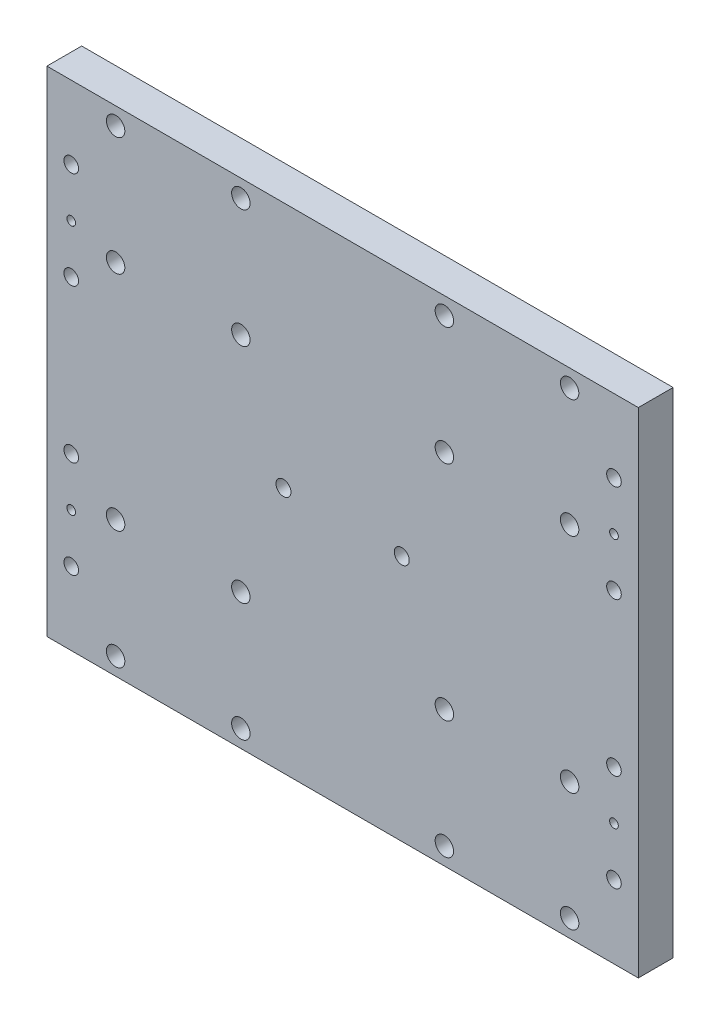
ISO-10303-21;
HEADER;
FILE_DESCRIPTION(('STEP AP214'),'2;1');
FILE_NAME('part.step','',(''),(''),'','','');
FILE_SCHEMA(('AUTOMOTIVE_DESIGN { 1 0 10303 214 1 1 1 1 }'));
ENDSEC;
DATA;
#1=APPLICATION_CONTEXT('core data for automotive mechanical design processes');
#2=APPLICATION_PROTOCOL_DEFINITION('international standard','automotive_design',2000,#1);
#3=PRODUCT_CONTEXT('',#1,'mechanical');
#4=PRODUCT('Part','Part','',(#3));
#5=PRODUCT_RELATED_PRODUCT_CATEGORY('part','',(#4));
#6=PRODUCT_DEFINITION_FORMATION('','',#4);
#7=PRODUCT_DEFINITION_CONTEXT('part definition',#1,'design');
#8=PRODUCT_DEFINITION('design','',#6,#7);
#9=PRODUCT_DEFINITION_SHAPE('','',#8);
#10=(LENGTH_UNIT() NAMED_UNIT(*) SI_UNIT(.MILLI.,.METRE.));
#11=(NAMED_UNIT(*) PLANE_ANGLE_UNIT() SI_UNIT($,.RADIAN.));
#12=(NAMED_UNIT(*) SI_UNIT($,.STERADIAN.) SOLID_ANGLE_UNIT());
#13=UNCERTAINTY_MEASURE_WITH_UNIT(LENGTH_MEASURE(1.E-05),#10,'distance_accuracy_value','');
#14=(GEOMETRIC_REPRESENTATION_CONTEXT(3) GLOBAL_UNCERTAINTY_ASSIGNED_CONTEXT((#13)) GLOBAL_UNIT_ASSIGNED_CONTEXT((#10,
#11,#12)) REPRESENTATION_CONTEXT('',''));
#15=CARTESIAN_POINT('',(0.,0.,0.));
#16=DIRECTION('',(0.,0.,1.));
#17=DIRECTION('',(1.,0.,0.));
#18=AXIS2_PLACEMENT_3D('',#15,#16,#17);
#19=CARTESIAN_POINT('',(0.,0.,5.));
#20=DIRECTION('',(0.,0.,1.));
#21=DIRECTION('',(1.,0.,0.));
#22=AXIS2_PLACEMENT_3D('',#19,#20,#21);
#23=PLANE('',#22);
#24=CARTESIAN_POINT('',(78.0000000000001,36.,5.));
#25=DIRECTION('',(0.,0.,-1.));
#26=DIRECTION('',(-1.,0.,0.));
#27=AXIS2_PLACEMENT_3D('',#24,#25,#26);
#28=CIRCLE('',#27,1.25);
#29=CARTESIAN_POINT('',(76.7500000000001,36.,5.));
#30=VERTEX_POINT('',#29);
#31=EDGE_CURVE('E131',#30,#30,#28,.T.);
#32=ORIENTED_EDGE('',*,*,#31,.T.);
#33=EDGE_LOOP('',(#32));
#34=FACE_BOUND('',#33,.T.);
#35=CARTESIAN_POINT('',(78.0000000000001,50.,5.));
#36=DIRECTION('',(0.,0.,1.));
#37=DIRECTION('',(1.,0.,0.));
#38=AXIS2_PLACEMENT_3D('',#35,#36,#37);
#39=CIRCLE('',#38,2.09999999999999);
#40=CARTESIAN_POINT('',(80.1000000000001,50.,5.));
#41=VERTEX_POINT('',#40);
#42=EDGE_CURVE('E127',#41,#41,#39,.T.);
#43=ORIENTED_EDGE('',*,*,#42,.F.);
#44=EDGE_LOOP('',(#43));
#45=FACE_BOUND('',#44,.T.);
#46=CARTESIAN_POINT('',(78.0000000000001,22.,5.));
#47=DIRECTION('',(0.,0.,1.));
#48=DIRECTION('',(1.,0.,0.));
#49=AXIS2_PLACEMENT_3D('',#46,#47,#48);
#50=CIRCLE('',#49,2.09999999999999);
#51=CARTESIAN_POINT('',(80.1000000000001,22.,5.));
#52=VERTEX_POINT('',#51);
#53=EDGE_CURVE('E123',#52,#52,#50,.T.);
#54=ORIENTED_EDGE('',*,*,#53,.F.);
#55=EDGE_LOOP('',(#54));
#56=FACE_BOUND('',#55,.T.);
#57=CARTESIAN_POINT('',(-78.0000000000001,36.,5.));
#58=DIRECTION('',(0.,0.,1.));
#59=DIRECTION('',(1.,0.,0.));
#60=AXIS2_PLACEMENT_3D('',#57,#58,#59);
#61=CIRCLE('',#60,1.25);
#62=CARTESIAN_POINT('',(-76.7500000000001,36.,5.));
#63=VERTEX_POINT('',#62);
#64=EDGE_CURVE('E122',#63,#63,#61,.T.);
#65=ORIENTED_EDGE('',*,*,#64,.F.);
#66=EDGE_LOOP('',(#65));
#67=FACE_BOUND('',#66,.T.);
#68=CARTESIAN_POINT('',(-78.0000000000001,50.,5.));
#69=DIRECTION('',(0.,0.,1.));
#70=DIRECTION('',(1.,0.,0.));
#71=AXIS2_PLACEMENT_3D('',#68,#69,#70);
#72=CIRCLE('',#71,2.09999999999999);
#73=CARTESIAN_POINT('',(-75.9000000000001,50.,5.));
#74=VERTEX_POINT('',#73);
#75=EDGE_CURVE('E118',#74,#74,#72,.T.);
#76=ORIENTED_EDGE('',*,*,#75,.F.);
#77=EDGE_LOOP('',(#76));
#78=FACE_BOUND('',#77,.T.);
#79=CARTESIAN_POINT('',(-78.0000000000001,22.,5.));
#80=DIRECTION('',(0.,0.,1.));
#81=DIRECTION('',(1.,0.,0.));
#82=AXIS2_PLACEMENT_3D('',#79,#80,#81);
#83=CIRCLE('',#82,2.09999999999999);
#84=CARTESIAN_POINT('',(-75.9000000000001,22.,5.));
#85=VERTEX_POINT('',#84);
#86=EDGE_CURVE('E114',#85,#85,#83,.T.);
#87=ORIENTED_EDGE('',*,*,#86,.F.);
#88=EDGE_LOOP('',(#87));
#89=FACE_BOUND('',#88,.T.);
#90=CARTESIAN_POINT('',(-17.,0.,5.));
#91=DIRECTION('',(0.,0.,1.));
#92=DIRECTION('',(1.,0.,0.));
#93=AXIS2_PLACEMENT_3D('',#90,#91,#92);
#94=CIRCLE('',#93,2.14999999999999);
#95=CARTESIAN_POINT('',(-14.85,0.,5.));
#96=VERTEX_POINT('',#95);
#97=EDGE_CURVE('E113',#96,#96,#94,.T.);
#98=ORIENTED_EDGE('',*,*,#97,.F.);
#99=EDGE_LOOP('',(#98));
#100=FACE_BOUND('',#99,.T.);
#101=CARTESIAN_POINT('',(17.,0.,5.));
#102=DIRECTION('',(0.,0.,1.));
#103=DIRECTION('',(1.,0.,0.));
#104=AXIS2_PLACEMENT_3D('',#101,#102,#103);
#105=CIRCLE('',#104,2.14999999999999);
#106=CARTESIAN_POINT('',(19.15,0.,5.));
#107=VERTEX_POINT('',#106);
#108=EDGE_CURVE('E183',#107,#107,#105,.T.);
#109=ORIENTED_EDGE('',*,*,#108,.F.);
#110=EDGE_LOOP('',(#109));
#111=FACE_BOUND('',#110,.T.);
#112=CARTESIAN_POINT('',(65.2500000000001,66.0000000000001,5.));
#113=DIRECTION('',(0.,0.,1.));
#114=DIRECTION('',(1.,0.,0.));
#115=AXIS2_PLACEMENT_3D('',#112,#113,#114);
#116=CIRCLE('',#115,2.65);
#117=CARTESIAN_POINT('',(67.9000000000001,66.0000000000001,5.));
#118=VERTEX_POINT('',#117);
#119=EDGE_CURVE('E189',#118,#118,#116,.T.);
#120=ORIENTED_EDGE('',*,*,#119,.F.);
#121=EDGE_LOOP('',(#120));
#122=FACE_BOUND('',#121,.T.);
#123=CARTESIAN_POINT('',(29.2500000000001,66.0000000000001,5.));
#124=DIRECTION('',(0.,0.,1.));
#125=DIRECTION('',(1.,0.,0.));
#126=AXIS2_PLACEMENT_3D('',#123,#124,#125);
#127=CIRCLE('',#126,2.65);
#128=CARTESIAN_POINT('',(31.9000000000001,66.0000000000001,5.));
#129=VERTEX_POINT('',#128);
#130=EDGE_CURVE('E195',#129,#129,#127,.T.);
#131=ORIENTED_EDGE('',*,*,#130,.F.);
#132=EDGE_LOOP('',(#131));
#133=FACE_BOUND('',#132,.T.);
#134=CARTESIAN_POINT('',(29.2500000000001,32.0000000000001,5.));
#135=DIRECTION('',(0.,0.,1.));
#136=DIRECTION('',(1.,0.,0.));
#137=AXIS2_PLACEMENT_3D('',#134,#135,#136);
#138=CIRCLE('',#137,2.65);
#139=CARTESIAN_POINT('',(31.9000000000001,32.0000000000001,5.));
#140=VERTEX_POINT('',#139);
#141=EDGE_CURVE('E201',#140,#140,#138,.T.);
#142=ORIENTED_EDGE('',*,*,#141,.F.);
#143=EDGE_LOOP('',(#142));
#144=FACE_BOUND('',#143,.T.);
#145=CARTESIAN_POINT('',(65.2500000000001,32.,5.));
#146=DIRECTION('',(0.,0.,1.));
#147=DIRECTION('',(1.,0.,0.));
#148=AXIS2_PLACEMENT_3D('',#145,#146,#147);
#149=CIRCLE('',#148,2.65);
#150=CARTESIAN_POINT('',(67.9000000000001,32.,5.));
#151=VERTEX_POINT('',#150);
#152=EDGE_CURVE('E207',#151,#151,#149,.T.);
#153=ORIENTED_EDGE('',*,*,#152,.F.);
#154=EDGE_LOOP('',(#153));
#155=FACE_BOUND('',#154,.T.);
#156=CARTESIAN_POINT('',(65.2500000000001,-66.0000000000001,5.));
#157=DIRECTION('',(0.,0.,1.));
#158=DIRECTION('',(1.,0.,0.));
#159=AXIS2_PLACEMENT_3D('',#156,#157,#158);
#160=CIRCLE('',#159,2.65);
#161=CARTESIAN_POINT('',(67.9000000000001,-66.0000000000001,5.));
#162=VERTEX_POINT('',#161);
#163=EDGE_CURVE('E213',#162,#162,#160,.T.);
#164=ORIENTED_EDGE('',*,*,#163,.F.);
#165=EDGE_LOOP('',(#164));
#166=FACE_BOUND('',#165,.T.);
#167=CARTESIAN_POINT('',(29.2500000000001,-66.0000000000001,5.));
#168=DIRECTION('',(0.,0.,1.));
#169=DIRECTION('',(1.,0.,0.));
#170=AXIS2_PLACEMENT_3D('',#167,#168,#169);
#171=CIRCLE('',#170,2.65);
#172=CARTESIAN_POINT('',(31.9000000000001,-66.0000000000001,5.));
#173=VERTEX_POINT('',#172);
#174=EDGE_CURVE('E219',#173,#173,#171,.T.);
#175=ORIENTED_EDGE('',*,*,#174,.F.);
#176=EDGE_LOOP('',(#175));
#177=FACE_BOUND('',#176,.T.);
#178=CARTESIAN_POINT('',(29.2500000000001,-32.0000000000001,5.));
#179=DIRECTION('',(0.,0.,1.));
#180=DIRECTION('',(1.,0.,0.));
#181=AXIS2_PLACEMENT_3D('',#178,#179,#180);
#182=CIRCLE('',#181,2.65);
#183=CARTESIAN_POINT('',(31.9000000000001,-32.0000000000001,5.));
#184=VERTEX_POINT('',#183);
#185=EDGE_CURVE('E225',#184,#184,#182,.T.);
#186=ORIENTED_EDGE('',*,*,#185,.F.);
#187=EDGE_LOOP('',(#186));
#188=FACE_BOUND('',#187,.T.);
#189=CARTESIAN_POINT('',(65.2500000000001,-32.,5.));
#190=DIRECTION('',(0.,0.,1.));
#191=DIRECTION('',(1.,0.,0.));
#192=AXIS2_PLACEMENT_3D('',#189,#190,#191);
#193=CIRCLE('',#192,2.65);
#194=CARTESIAN_POINT('',(67.9000000000001,-32.,5.));
#195=VERTEX_POINT('',#194);
#196=EDGE_CURVE('E231',#195,#195,#193,.T.);
#197=ORIENTED_EDGE('',*,*,#196,.F.);
#198=EDGE_LOOP('',(#197));
#199=FACE_BOUND('',#198,.T.);
#200=CARTESIAN_POINT('',(-65.2500000000001,-66.0000000000001,5.));
#201=DIRECTION('',(0.,0.,1.));
#202=DIRECTION('',(1.,0.,0.));
#203=AXIS2_PLACEMENT_3D('',#200,#201,#202);
#204=CIRCLE('',#203,2.65);
#205=CARTESIAN_POINT('',(-62.6000000000001,-66.0000000000001,5.));
#206=VERTEX_POINT('',#205);
#207=EDGE_CURVE('E237',#206,#206,#204,.T.);
#208=ORIENTED_EDGE('',*,*,#207,.F.);
#209=EDGE_LOOP('',(#208));
#210=FACE_BOUND('',#209,.T.);
#211=CARTESIAN_POINT('',(-29.2500000000001,-66.0000000000001,5.));
#212=DIRECTION('',(0.,0.,1.));
#213=DIRECTION('',(1.,0.,0.));
#214=AXIS2_PLACEMENT_3D('',#211,#212,#213);
#215=CIRCLE('',#214,2.65);
#216=CARTESIAN_POINT('',(-26.6000000000001,-66.0000000000001,5.));
#217=VERTEX_POINT('',#216);
#218=EDGE_CURVE('E243',#217,#217,#215,.T.);
#219=ORIENTED_EDGE('',*,*,#218,.F.);
#220=EDGE_LOOP('',(#219));
#221=FACE_BOUND('',#220,.T.);
#222=CARTESIAN_POINT('',(-29.2500000000001,-32.0000000000001,5.));
#223=DIRECTION('',(0.,0.,1.));
#224=DIRECTION('',(1.,0.,0.));
#225=AXIS2_PLACEMENT_3D('',#222,#223,#224);
#226=CIRCLE('',#225,2.65);
#227=CARTESIAN_POINT('',(-26.6000000000001,-32.0000000000001,5.));
#228=VERTEX_POINT('',#227);
#229=EDGE_CURVE('E249',#228,#228,#226,.T.);
#230=ORIENTED_EDGE('',*,*,#229,.F.);
#231=EDGE_LOOP('',(#230));
#232=FACE_BOUND('',#231,.T.);
#233=CARTESIAN_POINT('',(-65.2500000000001,-32.,5.));
#234=DIRECTION('',(0.,0.,1.));
#235=DIRECTION('',(1.,0.,0.));
#236=AXIS2_PLACEMENT_3D('',#233,#234,#235);
#237=CIRCLE('',#236,2.65);
#238=CARTESIAN_POINT('',(-62.6000000000001,-32.,5.));
#239=VERTEX_POINT('',#238);
#240=EDGE_CURVE('E255',#239,#239,#237,.T.);
#241=ORIENTED_EDGE('',*,*,#240,.F.);
#242=EDGE_LOOP('',(#241));
#243=FACE_BOUND('',#242,.T.);
#244=CARTESIAN_POINT('',(-65.2500000000001,66.0000000000001,5.));
#245=DIRECTION('',(0.,0.,1.));
#246=DIRECTION('',(1.,0.,0.));
#247=AXIS2_PLACEMENT_3D('',#244,#245,#246);
#248=CIRCLE('',#247,2.65);
#249=CARTESIAN_POINT('',(-62.6000000000001,66.0000000000001,5.));
#250=VERTEX_POINT('',#249);
#251=EDGE_CURVE('E261',#250,#250,#248,.T.);
#252=ORIENTED_EDGE('',*,*,#251,.F.);
#253=EDGE_LOOP('',(#252));
#254=FACE_BOUND('',#253,.T.);
#255=CARTESIAN_POINT('',(-29.2500000000001,66.0000000000001,5.));
#256=DIRECTION('',(0.,0.,1.));
#257=DIRECTION('',(1.,0.,0.));
#258=AXIS2_PLACEMENT_3D('',#255,#256,#257);
#259=CIRCLE('',#258,2.65);
#260=CARTESIAN_POINT('',(-26.6000000000001,66.0000000000001,5.));
#261=VERTEX_POINT('',#260);
#262=EDGE_CURVE('E267',#261,#261,#259,.T.);
#263=ORIENTED_EDGE('',*,*,#262,.F.);
#264=EDGE_LOOP('',(#263));
#265=FACE_BOUND('',#264,.T.);
#266=CARTESIAN_POINT('',(-29.2500000000001,32.0000000000001,5.));
#267=DIRECTION('',(0.,0.,1.));
#268=DIRECTION('',(1.,0.,0.));
#269=AXIS2_PLACEMENT_3D('',#266,#267,#268);
#270=CIRCLE('',#269,2.65);
#271=CARTESIAN_POINT('',(-26.6000000000001,32.0000000000001,5.));
#272=VERTEX_POINT('',#271);
#273=EDGE_CURVE('E273',#272,#272,#270,.T.);
#274=ORIENTED_EDGE('',*,*,#273,.F.);
#275=EDGE_LOOP('',(#274));
#276=FACE_BOUND('',#275,.T.);
#277=CARTESIAN_POINT('',(-65.2500000000001,32.,5.));
#278=DIRECTION('',(0.,0.,1.));
#279=DIRECTION('',(1.,0.,0.));
#280=AXIS2_PLACEMENT_3D('',#277,#278,#279);
#281=CIRCLE('',#280,2.65);
#282=CARTESIAN_POINT('',(-62.6000000000001,32.,5.));
#283=VERTEX_POINT('',#282);
#284=EDGE_CURVE('E279',#283,#283,#281,.T.);
#285=ORIENTED_EDGE('',*,*,#284,.F.);
#286=EDGE_LOOP('',(#285));
#287=FACE_BOUND('',#286,.T.);
#288=DIRECTION('',(0.,-1.,0.));
#289=VECTOR('',#288,1.);
#290=CARTESIAN_POINT('',(-85.0000000000001,-71.,5.));
#291=LINE('',#290,#289);
#292=CARTESIAN_POINT('',(-85.0000000000001,71.,5.));
#293=VERTEX_POINT('',#292);
#294=CARTESIAN_POINT('',(-85.0000000000001,-71.,5.));
#295=VERTEX_POINT('',#294);
#296=EDGE_CURVE('E88',#293,#295,#291,.T.);
#297=ORIENTED_EDGE('',*,*,#296,.T.);
#298=DIRECTION('',(1.,0.,0.));
#299=VECTOR('',#298,1.);
#300=CARTESIAN_POINT('',(85.,-71.,5.));
#301=LINE('',#300,#299);
#302=CARTESIAN_POINT('',(85.,-71.,5.));
#303=VERTEX_POINT('',#302);
#304=EDGE_CURVE('E83',#295,#303,#301,.T.);
#305=ORIENTED_EDGE('',*,*,#304,.T.);
#306=DIRECTION('',(0.,1.,0.));
#307=VECTOR('',#306,1.);
#308=CARTESIAN_POINT('',(85.,-71.,5.));
#309=LINE('',#308,#307);
#310=CARTESIAN_POINT('',(85.,71.,5.));
#311=VERTEX_POINT('',#310);
#312=EDGE_CURVE('E86',#303,#311,#309,.T.);
#313=ORIENTED_EDGE('',*,*,#312,.T.);
#314=DIRECTION('',(-1.,0.,0.));
#315=VECTOR('',#314,1.);
#316=CARTESIAN_POINT('',(85.,71.,5.));
#317=LINE('',#316,#315);
#318=EDGE_CURVE('E53',#311,#293,#317,.T.);
#319=ORIENTED_EDGE('',*,*,#318,.T.);
#320=EDGE_LOOP('',(#297,#305,#313,#319));
#321=FACE_BOUND('',#320,.T.);
#322=CARTESIAN_POINT('',(78.0000000000001,-22.,5.));
#323=DIRECTION('',(0.,0.,1.));
#324=DIRECTION('',(1.,0.,0.));
#325=AXIS2_PLACEMENT_3D('',#322,#323,#324);
#326=CIRCLE('',#325,2.09999999999999);
#327=CARTESIAN_POINT('',(80.1000000000001,-22.,5.));
#328=VERTEX_POINT('',#327);
#329=EDGE_CURVE('E132',#328,#328,#326,.T.);
#330=ORIENTED_EDGE('',*,*,#329,.F.);
#331=EDGE_LOOP('',(#330));
#332=FACE_BOUND('',#331,.T.);
#333=CARTESIAN_POINT('',(78.0000000000001,-50.,5.));
#334=DIRECTION('',(0.,0.,1.));
#335=DIRECTION('',(1.,0.,0.));
#336=AXIS2_PLACEMENT_3D('',#333,#334,#335);
#337=CIRCLE('',#336,2.09999999999999);
#338=CARTESIAN_POINT('',(80.1000000000001,-50.,5.));
#339=VERTEX_POINT('',#338);
#340=EDGE_CURVE('E135',#339,#339,#337,.T.);
#341=ORIENTED_EDGE('',*,*,#340,.F.);
#342=EDGE_LOOP('',(#341));
#343=FACE_BOUND('',#342,.T.);
#344=CARTESIAN_POINT('',(78.0000000000001,-36.,5.));
#345=DIRECTION('',(0.,0.,1.));
#346=DIRECTION('',(-1.,0.,0.));
#347=AXIS2_PLACEMENT_3D('',#344,#345,#346);
#348=CIRCLE('',#347,1.25);
#349=CARTESIAN_POINT('',(76.7500000000001,-36.,5.));
#350=VERTEX_POINT('',#349);
#351=EDGE_CURVE('E138',#350,#350,#348,.T.);
#352=ORIENTED_EDGE('',*,*,#351,.F.);
#353=EDGE_LOOP('',(#352));
#354=FACE_BOUND('',#353,.T.);
#355=CARTESIAN_POINT('',(-78.0000000000001,-22.,5.));
#356=DIRECTION('',(0.,0.,1.));
#357=DIRECTION('',(1.,0.,0.));
#358=AXIS2_PLACEMENT_3D('',#355,#356,#357);
#359=CIRCLE('',#358,2.09999999999999);
#360=CARTESIAN_POINT('',(-75.9000000000001,-22.,5.));
#361=VERTEX_POINT('',#360);
#362=EDGE_CURVE('E139',#361,#361,#359,.T.);
#363=ORIENTED_EDGE('',*,*,#362,.F.);
#364=EDGE_LOOP('',(#363));
#365=FACE_BOUND('',#364,.T.);
#366=CARTESIAN_POINT('',(-78.0000000000001,-50.,5.));
#367=DIRECTION('',(0.,0.,1.));
#368=DIRECTION('',(1.,0.,0.));
#369=AXIS2_PLACEMENT_3D('',#366,#367,#368);
#370=CIRCLE('',#369,2.09999999999999);
#371=CARTESIAN_POINT('',(-75.9000000000001,-50.,5.));
#372=VERTEX_POINT('',#371);
#373=EDGE_CURVE('E150',#372,#372,#370,.T.);
#374=ORIENTED_EDGE('',*,*,#373,.F.);
#375=EDGE_LOOP('',(#374));
#376=FACE_BOUND('',#375,.T.);
#377=CARTESIAN_POINT('',(-78.0000000000001,-36.,5.));
#378=DIRECTION('',(0.,0.,-1.));
#379=DIRECTION('',(1.,0.,0.));
#380=AXIS2_PLACEMENT_3D('',#377,#378,#379);
#381=CIRCLE('',#380,1.25);
#382=CARTESIAN_POINT('',(-76.7500000000001,-36.,5.));
#383=VERTEX_POINT('',#382);
#384=EDGE_CURVE('E331',#383,#383,#381,.T.);
#385=ORIENTED_EDGE('',*,*,#384,.T.);
#386=EDGE_LOOP('',(#385));
#387=FACE_BOUND('',#386,.T.);
#388=ADVANCED_FACE('F34',(#34,#45,#56,#67,#78,#89,#100,#111,#122,#133,#144,#155,#166,#177,#188,
#199,#210,#221,#232,#243,#254,#265,#276,#287,#321,#332,#343,#354,#365,#376,#387),#23,.T.);
#389=CARTESIAN_POINT('',(0.,0.,-5.));
#390=DIRECTION('',(0.,0.,1.));
#391=DIRECTION('',(1.,0.,0.));
#392=AXIS2_PLACEMENT_3D('',#389,#390,#391);
#393=PLANE('',#392);
#394=CARTESIAN_POINT('',(78.0000000000001,36.,-5.));
#395=DIRECTION('',(0.,0.,-1.));
#396=DIRECTION('',(-1.,0.,0.));
#397=AXIS2_PLACEMENT_3D('',#394,#395,#396);
#398=CIRCLE('',#397,1.25);
#399=CARTESIAN_POINT('',(76.7500000000001,36.,-5.));
#400=VERTEX_POINT('',#399);
#401=EDGE_CURVE('E160',#400,#400,#398,.T.);
#402=ORIENTED_EDGE('',*,*,#401,.F.);
#403=EDGE_LOOP('',(#402));
#404=FACE_BOUND('',#403,.T.);
#405=CARTESIAN_POINT('',(78.0000000000001,50.,-5.));
#406=DIRECTION('',(0.,0.,1.));
#407=DIRECTION('',(1.,0.,0.));
#408=AXIS2_PLACEMENT_3D('',#405,#406,#407);
#409=CIRCLE('',#408,2.09999999999999);
#410=CARTESIAN_POINT('',(80.1000000000001,50.,-5.));
#411=VERTEX_POINT('',#410);
#412=EDGE_CURVE('E124',#411,#411,#409,.T.);
#413=ORIENTED_EDGE('',*,*,#412,.T.);
#414=EDGE_LOOP('',(#413));
#415=FACE_BOUND('',#414,.T.);
#416=CARTESIAN_POINT('',(78.0000000000001,22.,-5.));
#417=DIRECTION('',(0.,0.,1.));
#418=DIRECTION('',(1.,0.,0.));
#419=AXIS2_PLACEMENT_3D('',#416,#417,#418);
#420=CIRCLE('',#419,2.09999999999999);
#421=CARTESIAN_POINT('',(80.1000000000001,22.,-5.));
#422=VERTEX_POINT('',#421);
#423=EDGE_CURVE('E119',#422,#422,#420,.T.);
#424=ORIENTED_EDGE('',*,*,#423,.T.);
#425=EDGE_LOOP('',(#424));
#426=FACE_BOUND('',#425,.T.);
#427=CARTESIAN_POINT('',(-78.0000000000001,36.,-5.));
#428=DIRECTION('',(0.,0.,1.));
#429=DIRECTION('',(1.,0.,0.));
#430=AXIS2_PLACEMENT_3D('',#427,#428,#429);
#431=CIRCLE('',#430,1.25);
#432=CARTESIAN_POINT('',(-76.7500000000001,36.,-5.));
#433=VERTEX_POINT('',#432);
#434=EDGE_CURVE('E169',#433,#433,#431,.T.);
#435=ORIENTED_EDGE('',*,*,#434,.T.);
#436=EDGE_LOOP('',(#435));
#437=FACE_BOUND('',#436,.T.);
#438=CARTESIAN_POINT('',(-78.0000000000001,50.,-5.));
#439=DIRECTION('',(0.,0.,1.));
#440=DIRECTION('',(1.,0.,0.));
#441=AXIS2_PLACEMENT_3D('',#438,#439,#440);
#442=CIRCLE('',#441,2.09999999999999);
#443=CARTESIAN_POINT('',(-75.9000000000001,50.,-5.));
#444=VERTEX_POINT('',#443);
#445=EDGE_CURVE('E115',#444,#444,#442,.T.);
#446=ORIENTED_EDGE('',*,*,#445,.T.);
#447=EDGE_LOOP('',(#446));
#448=FACE_BOUND('',#447,.T.);
#449=CARTESIAN_POINT('',(-78.0000000000001,22.,-5.));
#450=DIRECTION('',(0.,0.,1.));
#451=DIRECTION('',(1.,0.,0.));
#452=AXIS2_PLACEMENT_3D('',#449,#450,#451);
#453=CIRCLE('',#452,2.09999999999999);
#454=CARTESIAN_POINT('',(-75.9000000000001,22.,-5.));
#455=VERTEX_POINT('',#454);
#456=EDGE_CURVE('E110',#455,#455,#453,.T.);
#457=ORIENTED_EDGE('',*,*,#456,.T.);
#458=EDGE_LOOP('',(#457));
#459=FACE_BOUND('',#458,.T.);
#460=CARTESIAN_POINT('',(-17.,0.,-4.99999999999999));
#461=DIRECTION('',(0.,0.,1.));
#462=DIRECTION('',(1.,0.,0.));
#463=AXIS2_PLACEMENT_3D('',#460,#461,#462);
#464=CIRCLE('',#463,2.14999999999999);
#465=CARTESIAN_POINT('',(-14.85,0.,-4.99999999999999));
#466=VERTEX_POINT('',#465);
#467=EDGE_CURVE('E180',#466,#466,#464,.T.);
#468=ORIENTED_EDGE('',*,*,#467,.T.);
#469=EDGE_LOOP('',(#468));
#470=FACE_BOUND('',#469,.T.);
#471=CARTESIAN_POINT('',(17.,0.,-4.99999999999999));
#472=DIRECTION('',(0.,0.,1.));
#473=DIRECTION('',(1.,0.,0.));
#474=AXIS2_PLACEMENT_3D('',#471,#472,#473);
#475=CIRCLE('',#474,2.14999999999999);
#476=CARTESIAN_POINT('',(19.15,0.,-4.99999999999999));
#477=VERTEX_POINT('',#476);
#478=EDGE_CURVE('E186',#477,#477,#475,.T.);
#479=ORIENTED_EDGE('',*,*,#478,.T.);
#480=EDGE_LOOP('',(#479));
#481=FACE_BOUND('',#480,.T.);
#482=CARTESIAN_POINT('',(65.2500000000001,66.0000000000001,-5.));
#483=DIRECTION('',(0.,0.,1.));
#484=DIRECTION('',(1.,0.,0.));
#485=AXIS2_PLACEMENT_3D('',#482,#483,#484);
#486=CIRCLE('',#485,2.65);
#487=CARTESIAN_POINT('',(67.9000000000001,66.0000000000001,-5.));
#488=VERTEX_POINT('',#487);
#489=EDGE_CURVE('E192',#488,#488,#486,.T.);
#490=ORIENTED_EDGE('',*,*,#489,.T.);
#491=EDGE_LOOP('',(#490));
#492=FACE_BOUND('',#491,.T.);
#493=CARTESIAN_POINT('',(29.2500000000001,66.0000000000001,-5.));
#494=DIRECTION('',(0.,0.,1.));
#495=DIRECTION('',(1.,0.,0.));
#496=AXIS2_PLACEMENT_3D('',#493,#494,#495);
#497=CIRCLE('',#496,2.65);
#498=CARTESIAN_POINT('',(31.9000000000001,66.0000000000001,-5.));
#499=VERTEX_POINT('',#498);
#500=EDGE_CURVE('E198',#499,#499,#497,.T.);
#501=ORIENTED_EDGE('',*,*,#500,.T.);
#502=EDGE_LOOP('',(#501));
#503=FACE_BOUND('',#502,.T.);
#504=CARTESIAN_POINT('',(29.2500000000001,32.0000000000001,-5.));
#505=DIRECTION('',(0.,0.,1.));
#506=DIRECTION('',(1.,0.,0.));
#507=AXIS2_PLACEMENT_3D('',#504,#505,#506);
#508=CIRCLE('',#507,2.65);
#509=CARTESIAN_POINT('',(31.9000000000001,32.0000000000001,-5.));
#510=VERTEX_POINT('',#509);
#511=EDGE_CURVE('E204',#510,#510,#508,.T.);
#512=ORIENTED_EDGE('',*,*,#511,.T.);
#513=EDGE_LOOP('',(#512));
#514=FACE_BOUND('',#513,.T.);
#515=CARTESIAN_POINT('',(65.2500000000001,32.,-5.));
#516=DIRECTION('',(0.,0.,1.));
#517=DIRECTION('',(1.,0.,0.));
#518=AXIS2_PLACEMENT_3D('',#515,#516,#517);
#519=CIRCLE('',#518,2.65);
#520=CARTESIAN_POINT('',(67.9000000000001,32.,-5.));
#521=VERTEX_POINT('',#520);
#522=EDGE_CURVE('E210',#521,#521,#519,.T.);
#523=ORIENTED_EDGE('',*,*,#522,.T.);
#524=EDGE_LOOP('',(#523));
#525=FACE_BOUND('',#524,.T.);
#526=CARTESIAN_POINT('',(65.2500000000001,-66.0000000000001,-5.));
#527=DIRECTION('',(0.,0.,1.));
#528=DIRECTION('',(1.,0.,0.));
#529=AXIS2_PLACEMENT_3D('',#526,#527,#528);
#530=CIRCLE('',#529,2.65);
#531=CARTESIAN_POINT('',(67.9000000000001,-66.0000000000001,-5.));
#532=VERTEX_POINT('',#531);
#533=EDGE_CURVE('E216',#532,#532,#530,.T.);
#534=ORIENTED_EDGE('',*,*,#533,.T.);
#535=EDGE_LOOP('',(#534));
#536=FACE_BOUND('',#535,.T.);
#537=CARTESIAN_POINT('',(29.2500000000001,-66.0000000000001,-5.));
#538=DIRECTION('',(0.,0.,1.));
#539=DIRECTION('',(1.,0.,0.));
#540=AXIS2_PLACEMENT_3D('',#537,#538,#539);
#541=CIRCLE('',#540,2.65);
#542=CARTESIAN_POINT('',(31.9000000000001,-66.0000000000001,-5.));
#543=VERTEX_POINT('',#542);
#544=EDGE_CURVE('E222',#543,#543,#541,.T.);
#545=ORIENTED_EDGE('',*,*,#544,.T.);
#546=EDGE_LOOP('',(#545));
#547=FACE_BOUND('',#546,.T.);
#548=CARTESIAN_POINT('',(29.2500000000001,-32.0000000000001,-5.));
#549=DIRECTION('',(0.,0.,1.));
#550=DIRECTION('',(1.,0.,0.));
#551=AXIS2_PLACEMENT_3D('',#548,#549,#550);
#552=CIRCLE('',#551,2.65);
#553=CARTESIAN_POINT('',(31.9000000000001,-32.0000000000001,-5.));
#554=VERTEX_POINT('',#553);
#555=EDGE_CURVE('E228',#554,#554,#552,.T.);
#556=ORIENTED_EDGE('',*,*,#555,.T.);
#557=EDGE_LOOP('',(#556));
#558=FACE_BOUND('',#557,.T.);
#559=CARTESIAN_POINT('',(65.2500000000001,-32.,-5.));
#560=DIRECTION('',(0.,0.,1.));
#561=DIRECTION('',(1.,0.,0.));
#562=AXIS2_PLACEMENT_3D('',#559,#560,#561);
#563=CIRCLE('',#562,2.65);
#564=CARTESIAN_POINT('',(67.9000000000001,-32.,-5.));
#565=VERTEX_POINT('',#564);
#566=EDGE_CURVE('E234',#565,#565,#563,.T.);
#567=ORIENTED_EDGE('',*,*,#566,.T.);
#568=EDGE_LOOP('',(#567));
#569=FACE_BOUND('',#568,.T.);
#570=CARTESIAN_POINT('',(-65.2500000000001,-66.0000000000001,-5.));
#571=DIRECTION('',(0.,0.,1.));
#572=DIRECTION('',(1.,0.,0.));
#573=AXIS2_PLACEMENT_3D('',#570,#571,#572);
#574=CIRCLE('',#573,2.65);
#575=CARTESIAN_POINT('',(-62.6000000000001,-66.0000000000001,-5.));
#576=VERTEX_POINT('',#575);
#577=EDGE_CURVE('E240',#576,#576,#574,.T.);
#578=ORIENTED_EDGE('',*,*,#577,.T.);
#579=EDGE_LOOP('',(#578));
#580=FACE_BOUND('',#579,.T.);
#581=CARTESIAN_POINT('',(-29.2500000000001,-66.0000000000001,-5.));
#582=DIRECTION('',(0.,0.,1.));
#583=DIRECTION('',(1.,0.,0.));
#584=AXIS2_PLACEMENT_3D('',#581,#582,#583);
#585=CIRCLE('',#584,2.65);
#586=CARTESIAN_POINT('',(-26.6000000000001,-66.0000000000001,-5.));
#587=VERTEX_POINT('',#586);
#588=EDGE_CURVE('E246',#587,#587,#585,.T.);
#589=ORIENTED_EDGE('',*,*,#588,.T.);
#590=EDGE_LOOP('',(#589));
#591=FACE_BOUND('',#590,.T.);
#592=CARTESIAN_POINT('',(-29.2500000000001,-32.0000000000001,-5.));
#593=DIRECTION('',(0.,0.,1.));
#594=DIRECTION('',(1.,0.,0.));
#595=AXIS2_PLACEMENT_3D('',#592,#593,#594);
#596=CIRCLE('',#595,2.65);
#597=CARTESIAN_POINT('',(-26.6000000000001,-32.0000000000001,-5.));
#598=VERTEX_POINT('',#597);
#599=EDGE_CURVE('E252',#598,#598,#596,.T.);
#600=ORIENTED_EDGE('',*,*,#599,.T.);
#601=EDGE_LOOP('',(#600));
#602=FACE_BOUND('',#601,.T.);
#603=CARTESIAN_POINT('',(-65.2500000000001,-32.,-5.));
#604=DIRECTION('',(0.,0.,1.));
#605=DIRECTION('',(1.,0.,0.));
#606=AXIS2_PLACEMENT_3D('',#603,#604,#605);
#607=CIRCLE('',#606,2.65);
#608=CARTESIAN_POINT('',(-62.6000000000001,-32.,-5.));
#609=VERTEX_POINT('',#608);
#610=EDGE_CURVE('E258',#609,#609,#607,.T.);
#611=ORIENTED_EDGE('',*,*,#610,.T.);
#612=EDGE_LOOP('',(#611));
#613=FACE_BOUND('',#612,.T.);
#614=CARTESIAN_POINT('',(-65.2500000000001,66.0000000000001,-5.));
#615=DIRECTION('',(0.,0.,1.));
#616=DIRECTION('',(1.,0.,0.));
#617=AXIS2_PLACEMENT_3D('',#614,#615,#616);
#618=CIRCLE('',#617,2.65);
#619=CARTESIAN_POINT('',(-62.6000000000001,66.0000000000001,-5.));
#620=VERTEX_POINT('',#619);
#621=EDGE_CURVE('E264',#620,#620,#618,.T.);
#622=ORIENTED_EDGE('',*,*,#621,.T.);
#623=EDGE_LOOP('',(#622));
#624=FACE_BOUND('',#623,.T.);
#625=CARTESIAN_POINT('',(-29.2500000000001,66.0000000000001,-5.));
#626=DIRECTION('',(0.,0.,1.));
#627=DIRECTION('',(1.,0.,0.));
#628=AXIS2_PLACEMENT_3D('',#625,#626,#627);
#629=CIRCLE('',#628,2.65);
#630=CARTESIAN_POINT('',(-26.6000000000001,66.0000000000001,-5.));
#631=VERTEX_POINT('',#630);
#632=EDGE_CURVE('E270',#631,#631,#629,.T.);
#633=ORIENTED_EDGE('',*,*,#632,.T.);
#634=EDGE_LOOP('',(#633));
#635=FACE_BOUND('',#634,.T.);
#636=CARTESIAN_POINT('',(-29.2500000000001,32.0000000000001,-5.));
#637=DIRECTION('',(0.,0.,1.));
#638=DIRECTION('',(1.,0.,0.));
#639=AXIS2_PLACEMENT_3D('',#636,#637,#638);
#640=CIRCLE('',#639,2.65);
#641=CARTESIAN_POINT('',(-26.6000000000001,32.0000000000001,-5.));
#642=VERTEX_POINT('',#641);
#643=EDGE_CURVE('E276',#642,#642,#640,.T.);
#644=ORIENTED_EDGE('',*,*,#643,.T.);
#645=EDGE_LOOP('',(#644));
#646=FACE_BOUND('',#645,.T.);
#647=CARTESIAN_POINT('',(-65.2500000000001,32.,-5.));
#648=DIRECTION('',(0.,0.,1.));
#649=DIRECTION('',(1.,0.,0.));
#650=AXIS2_PLACEMENT_3D('',#647,#648,#649);
#651=CIRCLE('',#650,2.65);
#652=CARTESIAN_POINT('',(-62.6000000000001,32.,-5.));
#653=VERTEX_POINT('',#652);
#654=EDGE_CURVE('E104',#653,#653,#651,.T.);
#655=ORIENTED_EDGE('',*,*,#654,.T.);
#656=EDGE_LOOP('',(#655));
#657=FACE_BOUND('',#656,.T.);
#658=DIRECTION('',(0.,-1.,0.));
#659=VECTOR('',#658,1.);
#660=CARTESIAN_POINT('',(-85.0000000000001,-71.,-5.));
#661=LINE('',#660,#659);
#662=CARTESIAN_POINT('',(-85.0000000000001,71.,-5.));
#663=VERTEX_POINT('',#662);
#664=CARTESIAN_POINT('',(-85.0000000000001,-71.,-5.));
#665=VERTEX_POINT('',#664);
#666=EDGE_CURVE('E101',#663,#665,#661,.T.);
#667=ORIENTED_EDGE('',*,*,#666,.F.);
#668=DIRECTION('',(-1.,0.,0.));
#669=VECTOR('',#668,1.);
#670=CARTESIAN_POINT('',(85.,71.,-5.));
#671=LINE('',#670,#669);
#672=CARTESIAN_POINT('',(85.,71.,-5.));
#673=VERTEX_POINT('',#672);
#674=EDGE_CURVE('E76',#673,#663,#671,.T.);
#675=ORIENTED_EDGE('',*,*,#674,.F.);
#676=DIRECTION('',(0.,1.,0.));
#677=VECTOR('',#676,1.);
#678=CARTESIAN_POINT('',(85.,-71.,-5.));
#679=LINE('',#678,#677);
#680=CARTESIAN_POINT('',(85.,-71.,-5.));
#681=VERTEX_POINT('',#680);
#682=EDGE_CURVE('E70',#681,#673,#679,.T.);
#683=ORIENTED_EDGE('',*,*,#682,.F.);
#684=DIRECTION('',(1.,0.,0.));
#685=VECTOR('',#684,1.);
#686=CARTESIAN_POINT('',(85.,-71.,-5.));
#687=LINE('',#686,#685);
#688=EDGE_CURVE('E92',#665,#681,#687,.T.);
#689=ORIENTED_EDGE('',*,*,#688,.F.);
#690=EDGE_LOOP('',(#667,#675,#683,#689));
#691=FACE_BOUND('',#690,.T.);
#692=CARTESIAN_POINT('',(78.0000000000001,-22.,-5.));
#693=DIRECTION('',(0.,0.,1.));
#694=DIRECTION('',(1.,0.,0.));
#695=AXIS2_PLACEMENT_3D('',#692,#693,#694);
#696=CIRCLE('',#695,2.09999999999999);
#697=CARTESIAN_POINT('',(80.1000000000001,-22.,-5.));
#698=VERTEX_POINT('',#697);
#699=EDGE_CURVE('E128',#698,#698,#696,.T.);
#700=ORIENTED_EDGE('',*,*,#699,.T.);
#701=EDGE_LOOP('',(#700));
#702=FACE_BOUND('',#701,.T.);
#703=CARTESIAN_POINT('',(78.0000000000001,-50.,-5.));
#704=DIRECTION('',(0.,0.,1.));
#705=DIRECTION('',(1.,0.,0.));
#706=AXIS2_PLACEMENT_3D('',#703,#704,#705);
#707=CIRCLE('',#706,2.09999999999999);
#708=CARTESIAN_POINT('',(80.1000000000001,-50.,-5.));
#709=VERTEX_POINT('',#708);
#710=EDGE_CURVE('E133',#709,#709,#707,.T.);
#711=ORIENTED_EDGE('',*,*,#710,.T.);
#712=EDGE_LOOP('',(#711));
#713=FACE_BOUND('',#712,.T.);
#714=CARTESIAN_POINT('',(78.0000000000001,-36.,-5.));
#715=DIRECTION('',(0.,0.,1.));
#716=DIRECTION('',(-1.,0.,0.));
#717=AXIS2_PLACEMENT_3D('',#714,#715,#716);
#718=CIRCLE('',#717,1.25);
#719=CARTESIAN_POINT('',(76.7500000000001,-36.,-5.));
#720=VERTEX_POINT('',#719);
#721=EDGE_CURVE('E143',#720,#720,#718,.T.);
#722=ORIENTED_EDGE('',*,*,#721,.T.);
#723=EDGE_LOOP('',(#722));
#724=FACE_BOUND('',#723,.T.);
#725=CARTESIAN_POINT('',(-78.0000000000001,-22.,-5.));
#726=DIRECTION('',(0.,0.,1.));
#727=DIRECTION('',(1.,0.,0.));
#728=AXIS2_PLACEMENT_3D('',#725,#726,#727);
#729=CIRCLE('',#728,2.09999999999999);
#730=CARTESIAN_POINT('',(-75.9000000000001,-22.,-5.));
#731=VERTEX_POINT('',#730);
#732=EDGE_CURVE('E136',#731,#731,#729,.T.);
#733=ORIENTED_EDGE('',*,*,#732,.T.);
#734=EDGE_LOOP('',(#733));
#735=FACE_BOUND('',#734,.T.);
#736=CARTESIAN_POINT('',(-78.0000000000001,-50.,-5.));
#737=DIRECTION('',(0.,0.,1.));
#738=DIRECTION('',(1.,0.,0.));
#739=AXIS2_PLACEMENT_3D('',#736,#737,#738);
#740=CIRCLE('',#739,2.09999999999999);
#741=CARTESIAN_POINT('',(-75.9000000000001,-50.,-5.));
#742=VERTEX_POINT('',#741);
#743=EDGE_CURVE('E38',#742,#742,#740,.T.);
#744=ORIENTED_EDGE('',*,*,#743,.T.);
#745=EDGE_LOOP('',(#744));
#746=FACE_BOUND('',#745,.T.);
#747=CARTESIAN_POINT('',(-78.0000000000001,-36.,-5.));
#748=DIRECTION('',(0.,0.,-1.));
#749=DIRECTION('',(1.,0.,0.));
#750=AXIS2_PLACEMENT_3D('',#747,#748,#749);
#751=CIRCLE('',#750,1.25);
#752=CARTESIAN_POINT('',(-76.7500000000001,-36.,-5.));
#753=VERTEX_POINT('',#752);
#754=EDGE_CURVE('E329',#753,#753,#751,.T.);
#755=ORIENTED_EDGE('',*,*,#754,.F.);
#756=EDGE_LOOP('',(#755));
#757=FACE_BOUND('',#756,.T.);
#758=ADVANCED_FACE('F285',(#404,#415,#426,#437,#448,#459,#470,#481,#492,#503,#514,#525,#536,
#547,#558,#569,#580,#591,#602,#613,#624,#635,#646,#657,#691,#702,#713,#724,#735,#746,#757),#393,.F.);
#759=CARTESIAN_POINT('',(-85.0000000000001,-71.,5.));
#760=DIRECTION('',(1.,0.,0.));
#761=DIRECTION('',(0.,1.,0.));
#762=AXIS2_PLACEMENT_3D('',#759,#760,#761);
#763=PLANE('',#762);
#764=ORIENTED_EDGE('',*,*,#666,.T.);
#765=DIRECTION('',(0.,0.,-1.));
#766=VECTOR('',#765,1.);
#767=CARTESIAN_POINT('',(-85.0000000000001,-71.,5.));
#768=LINE('',#767,#766);
#769=EDGE_CURVE('E11',#295,#665,#768,.T.);
#770=ORIENTED_EDGE('',*,*,#769,.F.);
#771=ORIENTED_EDGE('',*,*,#296,.F.);
#772=DIRECTION('',(0.,0.,-1.));
#773=VECTOR('',#772,1.);
#774=CARTESIAN_POINT('',(-85.0000000000001,71.,5.));
#775=LINE('',#774,#773);
#776=EDGE_CURVE('E97',#293,#663,#775,.T.);
#777=ORIENTED_EDGE('',*,*,#776,.T.);
#778=EDGE_LOOP('',(#764,#770,#771,#777));
#779=FACE_BOUND('',#778,.T.);
#780=ADVANCED_FACE('F36',(#779),#763,.F.);
#781=CARTESIAN_POINT('',(85.,-71.,5.));
#782=DIRECTION('',(0.,1.,0.));
#783=DIRECTION('',(-1.,0.,0.));
#784=AXIS2_PLACEMENT_3D('',#781,#782,#783);
#785=PLANE('',#784);
#786=ORIENTED_EDGE('',*,*,#688,.T.);
#787=DIRECTION('',(0.,0.,-1.));
#788=VECTOR('',#787,1.);
#789=CARTESIAN_POINT('',(85.,-71.,5.));
#790=LINE('',#789,#788);
#791=EDGE_CURVE('E44',#303,#681,#790,.T.);
#792=ORIENTED_EDGE('',*,*,#791,.F.);
#793=ORIENTED_EDGE('',*,*,#304,.F.);
#794=ORIENTED_EDGE('',*,*,#769,.T.);
#795=EDGE_LOOP('',(#786,#792,#793,#794));
#796=FACE_BOUND('',#795,.T.);
#797=ADVANCED_FACE('F91',(#796),#785,.F.);
#798=CARTESIAN_POINT('',(85.,-71.,5.));
#799=DIRECTION('',(-1.,0.,0.));
#800=DIRECTION('',(0.,0.,1.));
#801=AXIS2_PLACEMENT_3D('',#798,#799,#800);
#802=PLANE('',#801);
#803=ORIENTED_EDGE('',*,*,#682,.T.);
#804=DIRECTION('',(0.,0.,-1.));
#805=VECTOR('',#804,1.);
#806=CARTESIAN_POINT('',(85.,71.,5.));
#807=LINE('',#806,#805);
#808=EDGE_CURVE('E93',#311,#673,#807,.T.);
#809=ORIENTED_EDGE('',*,*,#808,.F.);
#810=ORIENTED_EDGE('',*,*,#312,.F.);
#811=ORIENTED_EDGE('',*,*,#791,.T.);
#812=EDGE_LOOP('',(#803,#809,#810,#811));
#813=FACE_BOUND('',#812,.T.);
#814=ADVANCED_FACE('F95',(#813),#802,.F.);
#815=CARTESIAN_POINT('',(85.,71.,5.));
#816=DIRECTION('',(0.,-1.,0.));
#817=DIRECTION('',(1.,0.,0.));
#818=AXIS2_PLACEMENT_3D('',#815,#816,#817);
#819=PLANE('',#818);
#820=ORIENTED_EDGE('',*,*,#674,.T.);
#821=ORIENTED_EDGE('',*,*,#776,.F.);
#822=ORIENTED_EDGE('',*,*,#318,.F.);
#823=ORIENTED_EDGE('',*,*,#808,.T.);
#824=EDGE_LOOP('',(#820,#821,#822,#823));
#825=FACE_BOUND('',#824,.T.);
#826=ADVANCED_FACE('F292',(#825),#819,.F.);
#827=CARTESIAN_POINT('',(-65.2500000000001,32.,5.));
#828=DIRECTION('',(0.,0.,1.));
#829=DIRECTION('',(1.,0.,0.));
#830=AXIS2_PLACEMENT_3D('',#827,#828,#829);
#831=CYLINDRICAL_SURFACE('',#830,2.65);
#832=ORIENTED_EDGE('',*,*,#654,.F.);
#833=EDGE_LOOP('',(#832));
#834=FACE_BOUND('',#833,.T.);
#835=ORIENTED_EDGE('',*,*,#284,.T.);
#836=EDGE_LOOP('',(#835));
#837=FACE_BOUND('',#836,.T.);
#838=ADVANCED_FACE('F288',(#834,#837),#831,.F.);
#839=CARTESIAN_POINT('',(-29.2500000000001,32.0000000000001,5.));
#840=DIRECTION('',(0.,0.,1.));
#841=DIRECTION('',(1.,0.,0.));
#842=AXIS2_PLACEMENT_3D('',#839,#840,#841);
#843=CYLINDRICAL_SURFACE('',#842,2.65);
#844=ORIENTED_EDGE('',*,*,#643,.F.);
#845=EDGE_LOOP('',(#844));
#846=FACE_BOUND('',#845,.T.);
#847=ORIENTED_EDGE('',*,*,#273,.T.);
#848=EDGE_LOOP('',(#847));
#849=FACE_BOUND('',#848,.T.);
#850=ADVANCED_FACE('F291',(#846,#849),#843,.F.);
#851=CARTESIAN_POINT('',(-29.2500000000001,66.0000000000001,5.));
#852=DIRECTION('',(0.,0.,1.));
#853=DIRECTION('',(1.,0.,0.));
#854=AXIS2_PLACEMENT_3D('',#851,#852,#853);
#855=CYLINDRICAL_SURFACE('',#854,2.65);
#856=ORIENTED_EDGE('',*,*,#632,.F.);
#857=EDGE_LOOP('',(#856));
#858=FACE_BOUND('',#857,.T.);
#859=ORIENTED_EDGE('',*,*,#262,.T.);
#860=EDGE_LOOP('',(#859));
#861=FACE_BOUND('',#860,.T.);
#862=ADVANCED_FACE('F446',(#858,#861),#855,.F.);
#863=CARTESIAN_POINT('',(-65.2500000000001,66.0000000000001,5.));
#864=DIRECTION('',(0.,0.,1.));
#865=DIRECTION('',(1.,0.,0.));
#866=AXIS2_PLACEMENT_3D('',#863,#864,#865);
#867=CYLINDRICAL_SURFACE('',#866,2.65);
#868=ORIENTED_EDGE('',*,*,#621,.F.);
#869=EDGE_LOOP('',(#868));
#870=FACE_BOUND('',#869,.T.);
#871=ORIENTED_EDGE('',*,*,#251,.T.);
#872=EDGE_LOOP('',(#871));
#873=FACE_BOUND('',#872,.T.);
#874=ADVANCED_FACE('F442',(#870,#873),#867,.F.);
#875=CARTESIAN_POINT('',(-65.2500000000001,-32.,5.));
#876=DIRECTION('',(0.,0.,1.));
#877=DIRECTION('',(1.,0.,0.));
#878=AXIS2_PLACEMENT_3D('',#875,#876,#877);
#879=CYLINDRICAL_SURFACE('',#878,2.65);
#880=ORIENTED_EDGE('',*,*,#610,.F.);
#881=EDGE_LOOP('',(#880));
#882=FACE_BOUND('',#881,.T.);
#883=ORIENTED_EDGE('',*,*,#240,.T.);
#884=EDGE_LOOP('',(#883));
#885=FACE_BOUND('',#884,.T.);
#886=ADVANCED_FACE('F438',(#882,#885),#879,.F.);
#887=CARTESIAN_POINT('',(-29.2500000000001,-32.0000000000001,5.));
#888=DIRECTION('',(0.,0.,1.));
#889=DIRECTION('',(1.,0.,0.));
#890=AXIS2_PLACEMENT_3D('',#887,#888,#889);
#891=CYLINDRICAL_SURFACE('',#890,2.65);
#892=ORIENTED_EDGE('',*,*,#599,.F.);
#893=EDGE_LOOP('',(#892));
#894=FACE_BOUND('',#893,.T.);
#895=ORIENTED_EDGE('',*,*,#229,.T.);
#896=EDGE_LOOP('',(#895));
#897=FACE_BOUND('',#896,.T.);
#898=ADVANCED_FACE('F434',(#894,#897),#891,.F.);
#899=CARTESIAN_POINT('',(-29.2500000000001,-66.0000000000001,5.));
#900=DIRECTION('',(0.,0.,1.));
#901=DIRECTION('',(1.,0.,0.));
#902=AXIS2_PLACEMENT_3D('',#899,#900,#901);
#903=CYLINDRICAL_SURFACE('',#902,2.65);
#904=ORIENTED_EDGE('',*,*,#588,.F.);
#905=EDGE_LOOP('',(#904));
#906=FACE_BOUND('',#905,.T.);
#907=ORIENTED_EDGE('',*,*,#218,.T.);
#908=EDGE_LOOP('',(#907));
#909=FACE_BOUND('',#908,.T.);
#910=ADVANCED_FACE('F430',(#906,#909),#903,.F.);
#911=CARTESIAN_POINT('',(-65.2500000000001,-66.0000000000001,5.));
#912=DIRECTION('',(0.,0.,1.));
#913=DIRECTION('',(1.,0.,0.));
#914=AXIS2_PLACEMENT_3D('',#911,#912,#913);
#915=CYLINDRICAL_SURFACE('',#914,2.65);
#916=ORIENTED_EDGE('',*,*,#577,.F.);
#917=EDGE_LOOP('',(#916));
#918=FACE_BOUND('',#917,.T.);
#919=ORIENTED_EDGE('',*,*,#207,.T.);
#920=EDGE_LOOP('',(#919));
#921=FACE_BOUND('',#920,.T.);
#922=ADVANCED_FACE('F426',(#918,#921),#915,.F.);
#923=CARTESIAN_POINT('',(65.2500000000001,-32.,5.));
#924=DIRECTION('',(0.,0.,1.));
#925=DIRECTION('',(1.,0.,0.));
#926=AXIS2_PLACEMENT_3D('',#923,#924,#925);
#927=CYLINDRICAL_SURFACE('',#926,2.65);
#928=ORIENTED_EDGE('',*,*,#566,.F.);
#929=EDGE_LOOP('',(#928));
#930=FACE_BOUND('',#929,.T.);
#931=ORIENTED_EDGE('',*,*,#196,.T.);
#932=EDGE_LOOP('',(#931));
#933=FACE_BOUND('',#932,.T.);
#934=ADVANCED_FACE('F422',(#930,#933),#927,.F.);
#935=CARTESIAN_POINT('',(29.2500000000001,-32.0000000000001,5.));
#936=DIRECTION('',(0.,0.,1.));
#937=DIRECTION('',(1.,0.,0.));
#938=AXIS2_PLACEMENT_3D('',#935,#936,#937);
#939=CYLINDRICAL_SURFACE('',#938,2.65);
#940=ORIENTED_EDGE('',*,*,#555,.F.);
#941=EDGE_LOOP('',(#940));
#942=FACE_BOUND('',#941,.T.);
#943=ORIENTED_EDGE('',*,*,#185,.T.);
#944=EDGE_LOOP('',(#943));
#945=FACE_BOUND('',#944,.T.);
#946=ADVANCED_FACE('F418',(#942,#945),#939,.F.);
#947=CARTESIAN_POINT('',(29.2500000000001,-66.0000000000001,5.));
#948=DIRECTION('',(0.,0.,1.));
#949=DIRECTION('',(1.,0.,0.));
#950=AXIS2_PLACEMENT_3D('',#947,#948,#949);
#951=CYLINDRICAL_SURFACE('',#950,2.65);
#952=ORIENTED_EDGE('',*,*,#544,.F.);
#953=EDGE_LOOP('',(#952));
#954=FACE_BOUND('',#953,.T.);
#955=ORIENTED_EDGE('',*,*,#174,.T.);
#956=EDGE_LOOP('',(#955));
#957=FACE_BOUND('',#956,.T.);
#958=ADVANCED_FACE('F414',(#954,#957),#951,.F.);
#959=CARTESIAN_POINT('',(65.2500000000001,-66.0000000000001,5.));
#960=DIRECTION('',(0.,0.,1.));
#961=DIRECTION('',(1.,0.,0.));
#962=AXIS2_PLACEMENT_3D('',#959,#960,#961);
#963=CYLINDRICAL_SURFACE('',#962,2.65);
#964=ORIENTED_EDGE('',*,*,#533,.F.);
#965=EDGE_LOOP('',(#964));
#966=FACE_BOUND('',#965,.T.);
#967=ORIENTED_EDGE('',*,*,#163,.T.);
#968=EDGE_LOOP('',(#967));
#969=FACE_BOUND('',#968,.T.);
#970=ADVANCED_FACE('F410',(#966,#969),#963,.F.);
#971=CARTESIAN_POINT('',(65.2500000000001,32.,5.));
#972=DIRECTION('',(0.,0.,1.));
#973=DIRECTION('',(1.,0.,0.));
#974=AXIS2_PLACEMENT_3D('',#971,#972,#973);
#975=CYLINDRICAL_SURFACE('',#974,2.65);
#976=ORIENTED_EDGE('',*,*,#522,.F.);
#977=EDGE_LOOP('',(#976));
#978=FACE_BOUND('',#977,.T.);
#979=ORIENTED_EDGE('',*,*,#152,.T.);
#980=EDGE_LOOP('',(#979));
#981=FACE_BOUND('',#980,.T.);
#982=ADVANCED_FACE('F406',(#978,#981),#975,.F.);
#983=CARTESIAN_POINT('',(29.2500000000001,32.0000000000001,5.));
#984=DIRECTION('',(0.,0.,1.));
#985=DIRECTION('',(1.,0.,0.));
#986=AXIS2_PLACEMENT_3D('',#983,#984,#985);
#987=CYLINDRICAL_SURFACE('',#986,2.65);
#988=ORIENTED_EDGE('',*,*,#511,.F.);
#989=EDGE_LOOP('',(#988));
#990=FACE_BOUND('',#989,.T.);
#991=ORIENTED_EDGE('',*,*,#141,.T.);
#992=EDGE_LOOP('',(#991));
#993=FACE_BOUND('',#992,.T.);
#994=ADVANCED_FACE('F402',(#990,#993),#987,.F.);
#995=CARTESIAN_POINT('',(29.2500000000001,66.0000000000001,5.));
#996=DIRECTION('',(0.,0.,1.));
#997=DIRECTION('',(1.,0.,0.));
#998=AXIS2_PLACEMENT_3D('',#995,#996,#997);
#999=CYLINDRICAL_SURFACE('',#998,2.65);
#1000=ORIENTED_EDGE('',*,*,#500,.F.);
#1001=EDGE_LOOP('',(#1000));
#1002=FACE_BOUND('',#1001,.T.);
#1003=ORIENTED_EDGE('',*,*,#130,.T.);
#1004=EDGE_LOOP('',(#1003));
#1005=FACE_BOUND('',#1004,.T.);
#1006=ADVANCED_FACE('F398',(#1002,#1005),#999,.F.);
#1007=CARTESIAN_POINT('',(65.2500000000001,66.0000000000001,5.));
#1008=DIRECTION('',(0.,0.,1.));
#1009=DIRECTION('',(1.,0.,0.));
#1010=AXIS2_PLACEMENT_3D('',#1007,#1008,#1009);
#1011=CYLINDRICAL_SURFACE('',#1010,2.65);
#1012=ORIENTED_EDGE('',*,*,#489,.F.);
#1013=EDGE_LOOP('',(#1012));
#1014=FACE_BOUND('',#1013,.T.);
#1015=ORIENTED_EDGE('',*,*,#119,.T.);
#1016=EDGE_LOOP('',(#1015));
#1017=FACE_BOUND('',#1016,.T.);
#1018=ADVANCED_FACE('F394',(#1014,#1017),#1011,.F.);
#1019=CARTESIAN_POINT('',(17.,0.,5.));
#1020=DIRECTION('',(0.,0.,1.));
#1021=DIRECTION('',(1.,0.,0.));
#1022=AXIS2_PLACEMENT_3D('',#1019,#1020,#1021);
#1023=CYLINDRICAL_SURFACE('',#1022,2.14999999999999);
#1024=ORIENTED_EDGE('',*,*,#478,.F.);
#1025=EDGE_LOOP('',(#1024));
#1026=FACE_BOUND('',#1025,.T.);
#1027=ORIENTED_EDGE('',*,*,#108,.T.);
#1028=EDGE_LOOP('',(#1027));
#1029=FACE_BOUND('',#1028,.T.);
#1030=ADVANCED_FACE('F390',(#1026,#1029),#1023,.F.);
#1031=CARTESIAN_POINT('',(-17.,0.,5.));
#1032=DIRECTION('',(0.,0.,1.));
#1033=DIRECTION('',(1.,0.,0.));
#1034=AXIS2_PLACEMENT_3D('',#1031,#1032,#1033);
#1035=CYLINDRICAL_SURFACE('',#1034,2.14999999999999);
#1036=ORIENTED_EDGE('',*,*,#467,.F.);
#1037=EDGE_LOOP('',(#1036));
#1038=FACE_BOUND('',#1037,.T.);
#1039=ORIENTED_EDGE('',*,*,#97,.T.);
#1040=EDGE_LOOP('',(#1039));
#1041=FACE_BOUND('',#1040,.T.);
#1042=ADVANCED_FACE('F386',(#1038,#1041),#1035,.F.);
#1043=CARTESIAN_POINT('',(-78.0000000000001,22.,5.));
#1044=DIRECTION('',(0.,0.,1.));
#1045=DIRECTION('',(1.,0.,0.));
#1046=AXIS2_PLACEMENT_3D('',#1043,#1044,#1045);
#1047=CYLINDRICAL_SURFACE('',#1046,2.09999999999999);
#1048=ORIENTED_EDGE('',*,*,#86,.T.);
#1049=EDGE_LOOP('',(#1048));
#1050=FACE_BOUND('',#1049,.T.);
#1051=ORIENTED_EDGE('',*,*,#456,.F.);
#1052=EDGE_LOOP('',(#1051));
#1053=FACE_BOUND('',#1052,.T.);
#1054=ADVANCED_FACE('F382',(#1050,#1053),#1047,.F.);
#1055=CARTESIAN_POINT('',(-78.0000000000001,50.,5.));
#1056=DIRECTION('',(0.,0.,1.));
#1057=DIRECTION('',(1.,0.,0.));
#1058=AXIS2_PLACEMENT_3D('',#1055,#1056,#1057);
#1059=CYLINDRICAL_SURFACE('',#1058,2.09999999999999);
#1060=ORIENTED_EDGE('',*,*,#75,.T.);
#1061=EDGE_LOOP('',(#1060));
#1062=FACE_BOUND('',#1061,.T.);
#1063=ORIENTED_EDGE('',*,*,#445,.F.);
#1064=EDGE_LOOP('',(#1063));
#1065=FACE_BOUND('',#1064,.T.);
#1066=ADVANCED_FACE('F378',(#1062,#1065),#1059,.F.);
#1067=CARTESIAN_POINT('',(-78.0000000000001,36.,-5.));
#1068=DIRECTION('',(0.,0.,1.));
#1069=DIRECTION('',(1.,0.,0.));
#1070=AXIS2_PLACEMENT_3D('',#1067,#1068,#1069);
#1071=CYLINDRICAL_SURFACE('',#1070,1.25);
#1072=ORIENTED_EDGE('',*,*,#434,.F.);
#1073=EDGE_LOOP('',(#1072));
#1074=FACE_BOUND('',#1073,.T.);
#1075=ORIENTED_EDGE('',*,*,#64,.T.);
#1076=EDGE_LOOP('',(#1075));
#1077=FACE_BOUND('',#1076,.T.);
#1078=ADVANCED_FACE('F374',(#1074,#1077),#1071,.F.);
#1079=CARTESIAN_POINT('',(78.0000000000001,22.,5.));
#1080=DIRECTION('',(0.,0.,1.));
#1081=DIRECTION('',(1.,0.,0.));
#1082=AXIS2_PLACEMENT_3D('',#1079,#1080,#1081);
#1083=CYLINDRICAL_SURFACE('',#1082,2.09999999999999);
#1084=ORIENTED_EDGE('',*,*,#53,.T.);
#1085=EDGE_LOOP('',(#1084));
#1086=FACE_BOUND('',#1085,.T.);
#1087=ORIENTED_EDGE('',*,*,#423,.F.);
#1088=EDGE_LOOP('',(#1087));
#1089=FACE_BOUND('',#1088,.T.);
#1090=ADVANCED_FACE('F370',(#1086,#1089),#1083,.F.);
#1091=CARTESIAN_POINT('',(78.0000000000001,50.,5.));
#1092=DIRECTION('',(0.,0.,1.));
#1093=DIRECTION('',(1.,0.,0.));
#1094=AXIS2_PLACEMENT_3D('',#1091,#1092,#1093);
#1095=CYLINDRICAL_SURFACE('',#1094,2.09999999999999);
#1096=ORIENTED_EDGE('',*,*,#42,.T.);
#1097=EDGE_LOOP('',(#1096));
#1098=FACE_BOUND('',#1097,.T.);
#1099=ORIENTED_EDGE('',*,*,#412,.F.);
#1100=EDGE_LOOP('',(#1099));
#1101=FACE_BOUND('',#1100,.T.);
#1102=ADVANCED_FACE('F366',(#1098,#1101),#1095,.F.);
#1103=CARTESIAN_POINT('',(78.0000000000001,36.,-5.));
#1104=DIRECTION('',(0.,0.,1.));
#1105=DIRECTION('',(1.,0.,0.));
#1106=AXIS2_PLACEMENT_3D('',#1103,#1104,#1105);
#1107=CYLINDRICAL_SURFACE('',#1106,1.25);
#1108=ORIENTED_EDGE('',*,*,#401,.T.);
#1109=EDGE_LOOP('',(#1108));
#1110=FACE_BOUND('',#1109,.T.);
#1111=ORIENTED_EDGE('',*,*,#31,.F.);
#1112=EDGE_LOOP('',(#1111));
#1113=FACE_BOUND('',#1112,.T.);
#1114=ADVANCED_FACE('F362',(#1110,#1113),#1107,.F.);
#1115=CARTESIAN_POINT('',(78.0000000000001,-22.,5.));
#1116=DIRECTION('',(0.,0.,1.));
#1117=DIRECTION('',(1.,0.,0.));
#1118=AXIS2_PLACEMENT_3D('',#1115,#1116,#1117);
#1119=CYLINDRICAL_SURFACE('',#1118,2.09999999999999);
#1120=ORIENTED_EDGE('',*,*,#329,.T.);
#1121=EDGE_LOOP('',(#1120));
#1122=FACE_BOUND('',#1121,.T.);
#1123=ORIENTED_EDGE('',*,*,#699,.F.);
#1124=EDGE_LOOP('',(#1123));
#1125=FACE_BOUND('',#1124,.T.);
#1126=ADVANCED_FACE('F358',(#1122,#1125),#1119,.F.);
#1127=CARTESIAN_POINT('',(78.0000000000001,-50.,5.));
#1128=DIRECTION('',(0.,0.,1.));
#1129=DIRECTION('',(1.,0.,0.));
#1130=AXIS2_PLACEMENT_3D('',#1127,#1128,#1129);
#1131=CYLINDRICAL_SURFACE('',#1130,2.09999999999999);
#1132=ORIENTED_EDGE('',*,*,#340,.T.);
#1133=EDGE_LOOP('',(#1132));
#1134=FACE_BOUND('',#1133,.T.);
#1135=ORIENTED_EDGE('',*,*,#710,.F.);
#1136=EDGE_LOOP('',(#1135));
#1137=FACE_BOUND('',#1136,.T.);
#1138=ADVANCED_FACE('F354',(#1134,#1137),#1131,.F.);
#1139=CARTESIAN_POINT('',(78.0000000000001,-36.,-5.));
#1140=DIRECTION('',(0.,0.,1.));
#1141=DIRECTION('',(1.,0.,0.));
#1142=AXIS2_PLACEMENT_3D('',#1139,#1140,#1141);
#1143=CYLINDRICAL_SURFACE('',#1142,1.25);
#1144=ORIENTED_EDGE('',*,*,#721,.F.);
#1145=EDGE_LOOP('',(#1144));
#1146=FACE_BOUND('',#1145,.T.);
#1147=ORIENTED_EDGE('',*,*,#351,.T.);
#1148=EDGE_LOOP('',(#1147));
#1149=FACE_BOUND('',#1148,.T.);
#1150=ADVANCED_FACE('F351',(#1146,#1149),#1143,.F.);
#1151=CARTESIAN_POINT('',(-78.0000000000001,-22.,5.));
#1152=DIRECTION('',(0.,0.,1.));
#1153=DIRECTION('',(1.,0.,0.));
#1154=AXIS2_PLACEMENT_3D('',#1151,#1152,#1153);
#1155=CYLINDRICAL_SURFACE('',#1154,2.09999999999999);
#1156=ORIENTED_EDGE('',*,*,#362,.T.);
#1157=EDGE_LOOP('',(#1156));
#1158=FACE_BOUND('',#1157,.T.);
#1159=ORIENTED_EDGE('',*,*,#732,.F.);
#1160=EDGE_LOOP('',(#1159));
#1161=FACE_BOUND('',#1160,.T.);
#1162=ADVANCED_FACE('F345',(#1158,#1161),#1155,.F.);
#1163=CARTESIAN_POINT('',(-78.0000000000001,-50.,5.));
#1164=DIRECTION('',(0.,0.,1.));
#1165=DIRECTION('',(1.,0.,0.));
#1166=AXIS2_PLACEMENT_3D('',#1163,#1164,#1165);
#1167=CYLINDRICAL_SURFACE('',#1166,2.09999999999999);
#1168=ORIENTED_EDGE('',*,*,#373,.T.);
#1169=EDGE_LOOP('',(#1168));
#1170=FACE_BOUND('',#1169,.T.);
#1171=ORIENTED_EDGE('',*,*,#743,.F.);
#1172=EDGE_LOOP('',(#1171));
#1173=FACE_BOUND('',#1172,.T.);
#1174=ADVANCED_FACE('F340',(#1170,#1173),#1167,.F.);
#1175=CARTESIAN_POINT('',(-78.0000000000001,-36.,-5.));
#1176=DIRECTION('',(0.,0.,1.));
#1177=DIRECTION('',(1.,0.,0.));
#1178=AXIS2_PLACEMENT_3D('',#1175,#1176,#1177);
#1179=CYLINDRICAL_SURFACE('',#1178,1.25);
#1180=ORIENTED_EDGE('',*,*,#754,.T.);
#1181=EDGE_LOOP('',(#1180));
#1182=FACE_BOUND('',#1181,.T.);
#1183=ORIENTED_EDGE('',*,*,#384,.F.);
#1184=EDGE_LOOP('',(#1183));
#1185=FACE_BOUND('',#1184,.T.);
#1186=ADVANCED_FACE('F338',(#1182,#1185),#1179,.F.);
#1187=CLOSED_SHELL('',(#388,#758,#780,#797,#814,#826,#838,#850,#862,#874,#886,#898,#910,#922,
#934,#946,#958,#970,#982,#994,#1006,#1018,#1030,#1042,#1054,#1066,#1078,#1090,#1102,#1114,#1126,
#1138,#1150,#1162,#1174,#1186));
#1188=MANIFOLD_SOLID_BREP('B2',#1187);
#1189=ADVANCED_BREP_SHAPE_REPRESENTATION('',(#18,#1188),#14);
#1190=SHAPE_DEFINITION_REPRESENTATION(#9,#1189);
ENDSEC;
END-ISO-10303-21;
